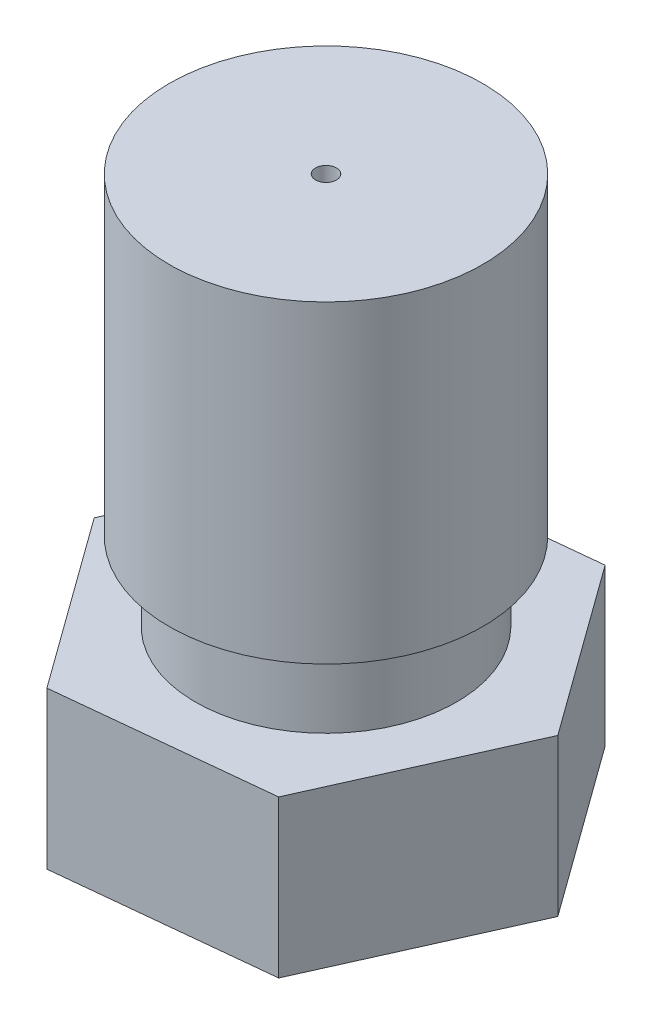
ISO-10303-21;
HEADER;
FILE_DESCRIPTION(('STEP AP214'),'2;1');
FILE_NAME('part.step','',(''),(''),'','','');
FILE_SCHEMA(('AUTOMOTIVE_DESIGN { 1 0 10303 214 1 1 1 1 }'));
ENDSEC;
DATA;
#1=APPLICATION_CONTEXT('core data for automotive mechanical design processes');
#2=APPLICATION_PROTOCOL_DEFINITION('international standard','automotive_design',2000,#1);
#3=PRODUCT_CONTEXT('',#1,'mechanical');
#4=PRODUCT('Part','Part','',(#3));
#5=PRODUCT_RELATED_PRODUCT_CATEGORY('part','',(#4));
#6=PRODUCT_DEFINITION_FORMATION('','',#4);
#7=PRODUCT_DEFINITION_CONTEXT('part definition',#1,'design');
#8=PRODUCT_DEFINITION('design','',#6,#7);
#9=PRODUCT_DEFINITION_SHAPE('','',#8);
#10=(LENGTH_UNIT() NAMED_UNIT(*) SI_UNIT(.MILLI.,.METRE.));
#11=(NAMED_UNIT(*) PLANE_ANGLE_UNIT() SI_UNIT($,.RADIAN.));
#12=(NAMED_UNIT(*) SI_UNIT($,.STERADIAN.) SOLID_ANGLE_UNIT());
#13=UNCERTAINTY_MEASURE_WITH_UNIT(LENGTH_MEASURE(1.E-05),#10,'distance_accuracy_value','');
#14=(GEOMETRIC_REPRESENTATION_CONTEXT(3) GLOBAL_UNCERTAINTY_ASSIGNED_CONTEXT((#13)) GLOBAL_UNIT_ASSIGNED_CONTEXT((#10,
#11,#12)) REPRESENTATION_CONTEXT('',''));
#15=CARTESIAN_POINT('',(0.,0.,0.));
#16=DIRECTION('',(0.,0.,1.));
#17=DIRECTION('',(1.,0.,0.));
#18=AXIS2_PLACEMENT_3D('',#15,#16,#17);
#19=CARTESIAN_POINT('',(0.,12.5,0.));
#20=DIRECTION('',(0.,-1.,0.));
#21=DIRECTION('',(1.,0.,0.));
#22=AXIS2_PLACEMENT_3D('',#19,#20,#21);
#23=PLANE('',#22);
#24=CARTESIAN_POINT('',(0.,12.5,0.));
#25=DIRECTION('',(0.,-1.,0.));
#26=DIRECTION('',(1.,0.,0.));
#27=AXIS2_PLACEMENT_3D('',#24,#25,#26);
#28=CIRCLE('',#27,0.2);
#29=CARTESIAN_POINT('',(0.200000000000001,12.5,0.));
#30=VERTEX_POINT('',#29);
#31=EDGE_CURVE('E151',#30,#30,#28,.T.);
#32=ORIENTED_EDGE('',*,*,#31,.T.);
#33=EDGE_LOOP('',(#32));
#34=FACE_BOUND('',#33,.T.);
#35=CARTESIAN_POINT('',(0.,12.5,0.));
#36=DIRECTION('',(0.,1.,0.));
#37=DIRECTION('',(-1.,0.,0.));
#38=AXIS2_PLACEMENT_3D('',#35,#36,#37);
#39=CIRCLE('',#38,3.);
#40=CARTESIAN_POINT('',(-3.,12.5,0.));
#41=VERTEX_POINT('',#40);
#42=EDGE_CURVE('E107',#41,#41,#39,.T.);
#43=ORIENTED_EDGE('',*,*,#42,.T.);
#44=EDGE_LOOP('',(#43));
#45=FACE_BOUND('',#44,.T.);
#46=ADVANCED_FACE('F33',(#34,#45),#23,.F.);
#47=CARTESIAN_POINT('',(0.,5.,0.));
#48=DIRECTION('',(0.,-1.,0.));
#49=DIRECTION('',(1.,0.,0.));
#50=AXIS2_PLACEMENT_3D('',#47,#48,#49);
#51=PLANE('',#50);
#52=CARTESIAN_POINT('',(0.,5.,0.));
#53=DIRECTION('',(0.,1.,0.));
#54=DIRECTION('',(-1.,0.,0.));
#55=AXIS2_PLACEMENT_3D('',#52,#53,#54);
#56=CIRCLE('',#55,2.5);
#57=CARTESIAN_POINT('',(-2.5,5.,0.));
#58=VERTEX_POINT('',#57);
#59=EDGE_CURVE('E116',#58,#58,#56,.T.);
#60=ORIENTED_EDGE('',*,*,#59,.F.);
#61=EDGE_LOOP('',(#60));
#62=FACE_BOUND('',#61,.T.);
#63=DIRECTION('',(-0.40858111873719,0.,0.912722011026066));
#64=VECTOR('',#63,1.);
#65=CARTESIAN_POINT('',(-4.02015750470173,5.,0.414327130084022));
#66=LINE('',#65,#64);
#67=CARTESIAN_POINT('',(-2.36889657248073,5.,-3.27439496124435));
#68=VERTEX_POINT('',#67);
#69=CARTESIAN_POINT('',(-4.02015750470173,5.,0.414327130084022));
#70=VERTEX_POINT('',#69);
#71=EDGE_CURVE('E105',#68,#70,#66,.T.);
#72=ORIENTED_EDGE('',*,*,#71,.T.);
#73=DIRECTION('',(0.586149888773199,0.,0.810202633846106));
#74=VECTOR('',#73,1.);
#75=CARTESIAN_POINT('',(-1.651260932221,5.,3.68872209132837));
#76=LINE('',#75,#74);
#77=CARTESIAN_POINT('',(-1.651260932221,5.,3.68872209132837));
#78=VERTEX_POINT('',#77);
#79=EDGE_CURVE('E49',#70,#78,#76,.T.);
#80=ORIENTED_EDGE('',*,*,#79,.T.);
#81=DIRECTION('',(0.994731007510389,0.,-0.102519377179961));
#82=VECTOR('',#81,1.);
#83=CARTESIAN_POINT('',(2.36889657248073,5.,3.27439496124435));
#84=LINE('',#83,#82);
#85=CARTESIAN_POINT('',(2.36889657248073,5.,3.27439496124435));
#86=VERTEX_POINT('',#85);
#87=EDGE_CURVE('E82',#78,#86,#84,.T.);
#88=ORIENTED_EDGE('',*,*,#87,.T.);
#89=DIRECTION('',(0.408581118737189,0.,-0.912722011026066));
#90=VECTOR('',#89,1.);
#91=CARTESIAN_POINT('',(4.02015750470173,5.,-0.414327130084022));
#92=LINE('',#91,#90);
#93=CARTESIAN_POINT('',(4.02015750470173,5.,-0.414327130084022));
#94=VERTEX_POINT('',#93);
#95=EDGE_CURVE('E76',#86,#94,#92,.T.);
#96=ORIENTED_EDGE('',*,*,#95,.T.);
#97=DIRECTION('',(-0.586149888773199,0.,-0.810202633846106));
#98=VECTOR('',#97,1.);
#99=CARTESIAN_POINT('',(1.65126093222101,5.,-3.68872209132837));
#100=LINE('',#99,#98);
#101=CARTESIAN_POINT('',(1.65126093222101,5.,-3.68872209132837));
#102=VERTEX_POINT('',#101);
#103=EDGE_CURVE('E65',#94,#102,#100,.T.);
#104=ORIENTED_EDGE('',*,*,#103,.T.);
#105=DIRECTION('',(-0.994731007510389,0.,0.102519377179961));
#106=VECTOR('',#105,1.);
#107=CARTESIAN_POINT('',(-2.36889657248073,5.,-3.27439496124435));
#108=LINE('',#107,#106);
#109=EDGE_CURVE('E77',#102,#68,#108,.T.);
#110=ORIENTED_EDGE('',*,*,#109,.T.);
#111=EDGE_LOOP('',(#72,#80,#88,#96,#104,#110));
#112=FACE_BOUND('',#111,.T.);
#113=ADVANCED_FACE('F80',(#62,#112),#51,.F.);
#114=CARTESIAN_POINT('',(0.,12.5,0.));
#115=DIRECTION('',(0.,1.,0.));
#116=DIRECTION('',(-1.,0.,0.));
#117=AXIS2_PLACEMENT_3D('',#114,#115,#116);
#118=CYLINDRICAL_SURFACE('',#117,2.5);
#119=CARTESIAN_POINT('',(0.,6.5,0.));
#120=DIRECTION('',(0.,1.,0.));
#121=DIRECTION('',(-1.,0.,0.));
#122=AXIS2_PLACEMENT_3D('',#119,#120,#121);
#123=CIRCLE('',#122,2.5);
#124=CARTESIAN_POINT('',(-2.5,6.5,0.));
#125=VERTEX_POINT('',#124);
#126=EDGE_CURVE('E113',#125,#125,#123,.T.);
#127=ORIENTED_EDGE('',*,*,#126,.F.);
#128=EDGE_LOOP('',(#127));
#129=FACE_BOUND('',#128,.T.);
#130=ORIENTED_EDGE('',*,*,#59,.T.);
#131=EDGE_LOOP('',(#130));
#132=FACE_BOUND('',#131,.T.);
#133=ADVANCED_FACE('F145',(#129,#132),#118,.T.);
#134=CARTESIAN_POINT('',(0.,6.5,0.));
#135=DIRECTION('',(0.,1.,0.));
#136=DIRECTION('',(-1.,0.,0.));
#137=AXIS2_PLACEMENT_3D('',#134,#135,#136);
#138=PLANE('',#137);
#139=CARTESIAN_POINT('',(0.,6.5,0.));
#140=DIRECTION('',(0.,1.,0.));
#141=DIRECTION('',(-1.,0.,0.));
#142=AXIS2_PLACEMENT_3D('',#139,#140,#141);
#143=CIRCLE('',#142,3.);
#144=CARTESIAN_POINT('',(-3.,6.5,0.));
#145=VERTEX_POINT('',#144);
#146=EDGE_CURVE('E110',#145,#145,#143,.T.);
#147=ORIENTED_EDGE('',*,*,#146,.F.);
#148=EDGE_LOOP('',(#147));
#149=FACE_BOUND('',#148,.T.);
#150=ORIENTED_EDGE('',*,*,#126,.T.);
#151=EDGE_LOOP('',(#150));
#152=FACE_BOUND('',#151,.T.);
#153=ADVANCED_FACE('F158',(#149,#152),#138,.F.);
#154=CARTESIAN_POINT('',(0.,12.5,0.));
#155=DIRECTION('',(0.,1.,0.));
#156=DIRECTION('',(-1.,0.,0.));
#157=AXIS2_PLACEMENT_3D('',#154,#155,#156);
#158=CYLINDRICAL_SURFACE('',#157,3.);
#159=ORIENTED_EDGE('',*,*,#42,.F.);
#160=EDGE_LOOP('',(#159));
#161=FACE_BOUND('',#160,.T.);
#162=ORIENTED_EDGE('',*,*,#146,.T.);
#163=EDGE_LOOP('',(#162));
#164=FACE_BOUND('',#163,.T.);
#165=ADVANCED_FACE('F154',(#161,#164),#158,.T.);
#166=CARTESIAN_POINT('',(-1.651260932221,15.9120735022568,3.68872209132837));
#167=DIRECTION('',(-0.810202633846105,0.,0.586149888773199));
#168=DIRECTION('',(0.586149888773199,0.,0.810202633846106));
#169=AXIS2_PLACEMENT_3D('',#166,#167,#168);
#170=PLANE('',#169);
#171=ORIENTED_EDGE('',*,*,#79,.F.);
#172=DIRECTION('',(0.,-1.,0.));
#173=VECTOR('',#172,1.);
#174=CARTESIAN_POINT('',(-4.02015750470173,15.9120735022568,0.414327130084022));
#175=LINE('',#174,#173);
#176=CARTESIAN_POINT('',(-4.02015750470173,2.,0.414327130084022));
#177=VERTEX_POINT('',#176);
#178=EDGE_CURVE('E102',#70,#177,#175,.T.);
#179=ORIENTED_EDGE('',*,*,#178,.T.);
#180=DIRECTION('',(-0.586149888773199,0.,-0.810202633846105));
#181=VECTOR('',#180,1.);
#182=CARTESIAN_POINT('',(-1.651260932221,2.,3.68872209132837));
#183=LINE('',#182,#181);
#184=CARTESIAN_POINT('',(-1.651260932221,2.,3.68872209132837));
#185=VERTEX_POINT('',#184);
#186=EDGE_CURVE('E210',#185,#177,#183,.T.);
#187=ORIENTED_EDGE('',*,*,#186,.F.);
#188=DIRECTION('',(0.,-1.,0.));
#189=VECTOR('',#188,1.);
#190=CARTESIAN_POINT('',(-1.651260932221,15.9120735022568,3.68872209132837));
#191=LINE('',#190,#189);
#192=EDGE_CURVE('E94',#78,#185,#191,.T.);
#193=ORIENTED_EDGE('',*,*,#192,.F.);
#194=EDGE_LOOP('',(#171,#179,#187,#193));
#195=FACE_BOUND('',#194,.T.);
#196=ADVANCED_FACE('F157',(#195),#170,.T.);
#197=CARTESIAN_POINT('',(2.36889657248073,15.9120735022568,3.27439496124435));
#198=DIRECTION('',(0.102519377179961,0.,0.994731007510389));
#199=DIRECTION('',(0.994731007510389,0.,-0.102519377179961));
#200=AXIS2_PLACEMENT_3D('',#197,#198,#199);
#201=PLANE('',#200);
#202=ORIENTED_EDGE('',*,*,#87,.F.);
#203=ORIENTED_EDGE('',*,*,#192,.T.);
#204=DIRECTION('',(-0.994731007510389,0.,0.102519377179961));
#205=VECTOR('',#204,1.);
#206=CARTESIAN_POINT('',(2.36889657248073,2.,3.27439496124435));
#207=LINE('',#206,#205);
#208=CARTESIAN_POINT('',(2.36889657248073,2.,3.27439496124435));
#209=VERTEX_POINT('',#208);
#210=EDGE_CURVE('E104',#209,#185,#207,.T.);
#211=ORIENTED_EDGE('',*,*,#210,.F.);
#212=DIRECTION('',(0.,-1.,0.));
#213=VECTOR('',#212,1.);
#214=CARTESIAN_POINT('',(2.36889657248073,15.9120735022568,3.27439496124435));
#215=LINE('',#214,#213);
#216=EDGE_CURVE('E92',#86,#209,#215,.T.);
#217=ORIENTED_EDGE('',*,*,#216,.F.);
#218=EDGE_LOOP('',(#202,#203,#211,#217));
#219=FACE_BOUND('',#218,.T.);
#220=ADVANCED_FACE('F222',(#219),#201,.T.);
#221=CARTESIAN_POINT('',(4.02015750470173,15.9120735022568,-0.414327130084022));
#222=DIRECTION('',(0.912722011026066,0.,0.408581118737189));
#223=DIRECTION('',(0.408581118737189,0.,-0.912722011026066));
#224=AXIS2_PLACEMENT_3D('',#221,#222,#223);
#225=PLANE('',#224);
#226=DIRECTION('',(0.,-1.,0.));
#227=VECTOR('',#226,1.);
#228=CARTESIAN_POINT('',(4.02015750470173,15.9120735022568,-0.414327130084022));
#229=LINE('',#228,#227);
#230=CARTESIAN_POINT('',(4.02015750470173,2.,-0.414327130084022));
#231=VERTEX_POINT('',#230);
#232=EDGE_CURVE('E71',#94,#231,#229,.T.);
#233=ORIENTED_EDGE('',*,*,#232,.F.);
#234=ORIENTED_EDGE('',*,*,#95,.F.);
#235=ORIENTED_EDGE('',*,*,#216,.T.);
#236=DIRECTION('',(-0.408581118737189,0.,0.912722011026066));
#237=VECTOR('',#236,1.);
#238=CARTESIAN_POINT('',(4.02015750470173,2.,-0.414327130084022));
#239=LINE('',#238,#237);
#240=EDGE_CURVE('E90',#231,#209,#239,.T.);
#241=ORIENTED_EDGE('',*,*,#240,.F.);
#242=EDGE_LOOP('',(#233,#234,#235,#241));
#243=FACE_BOUND('',#242,.T.);
#244=ADVANCED_FACE('F88',(#243),#225,.T.);
#245=CARTESIAN_POINT('',(1.65126093222101,15.9120735022568,-3.68872209132837));
#246=DIRECTION('',(0.810202633846106,0.,-0.586149888773199));
#247=DIRECTION('',(-0.586149888773199,0.,-0.810202633846106));
#248=AXIS2_PLACEMENT_3D('',#245,#246,#247);
#249=PLANE('',#248);
#250=ORIENTED_EDGE('',*,*,#103,.F.);
#251=ORIENTED_EDGE('',*,*,#232,.T.);
#252=DIRECTION('',(0.586149888773199,0.,0.810202633846106));
#253=VECTOR('',#252,1.);
#254=CARTESIAN_POINT('',(1.65126093222101,2.,-3.68872209132837));
#255=LINE('',#254,#253);
#256=CARTESIAN_POINT('',(1.65126093222101,2.,-3.68872209132837));
#257=VERTEX_POINT('',#256);
#258=EDGE_CURVE('E183',#257,#231,#255,.T.);
#259=ORIENTED_EDGE('',*,*,#258,.F.);
#260=DIRECTION('',(0.,-1.,0.));
#261=VECTOR('',#260,1.);
#262=CARTESIAN_POINT('',(1.65126093222101,15.9120735022568,-3.68872209132837));
#263=LINE('',#262,#261);
#264=EDGE_CURVE('E73',#102,#257,#263,.T.);
#265=ORIENTED_EDGE('',*,*,#264,.F.);
#266=EDGE_LOOP('',(#250,#251,#259,#265));
#267=FACE_BOUND('',#266,.T.);
#268=ADVANCED_FACE('F67',(#267),#249,.T.);
#269=CARTESIAN_POINT('',(-2.36889657248073,15.9120735022568,-3.27439496124435));
#270=DIRECTION('',(-0.102519377179961,0.,-0.994731007510389));
#271=DIRECTION('',(-0.994731007510389,0.,0.102519377179961));
#272=AXIS2_PLACEMENT_3D('',#269,#270,#271);
#273=PLANE('',#272);
#274=ORIENTED_EDGE('',*,*,#109,.F.);
#275=ORIENTED_EDGE('',*,*,#264,.T.);
#276=DIRECTION('',(0.994731007510389,0.,-0.102519377179961));
#277=VECTOR('',#276,1.);
#278=CARTESIAN_POINT('',(-2.36889657248073,2.,-3.27439496124435));
#279=LINE('',#278,#277);
#280=CARTESIAN_POINT('',(-2.36889657248073,2.,-3.27439496124435));
#281=VERTEX_POINT('',#280);
#282=EDGE_CURVE('E189',#281,#257,#279,.T.);
#283=ORIENTED_EDGE('',*,*,#282,.F.);
#284=DIRECTION('',(0.,-1.,0.));
#285=VECTOR('',#284,1.);
#286=CARTESIAN_POINT('',(-2.36889657248073,15.9120735022568,-3.27439496124435));
#287=LINE('',#286,#285);
#288=EDGE_CURVE('E96',#68,#281,#287,.T.);
#289=ORIENTED_EDGE('',*,*,#288,.F.);
#290=EDGE_LOOP('',(#274,#275,#283,#289));
#291=FACE_BOUND('',#290,.T.);
#292=ADVANCED_FACE('F136',(#291),#273,.T.);
#293=CARTESIAN_POINT('',(-4.02015750470173,15.9120735022568,0.414327130084022));
#294=DIRECTION('',(-0.912722011026066,0.,-0.40858111873719));
#295=DIRECTION('',(-0.40858111873719,0.,0.912722011026066));
#296=AXIS2_PLACEMENT_3D('',#293,#294,#295);
#297=PLANE('',#296);
#298=ORIENTED_EDGE('',*,*,#71,.F.);
#299=ORIENTED_EDGE('',*,*,#288,.T.);
#300=DIRECTION('',(0.40858111873719,0.,-0.912722011026066));
#301=VECTOR('',#300,1.);
#302=CARTESIAN_POINT('',(-4.02015750470173,2.,0.414327130084022));
#303=LINE('',#302,#301);
#304=EDGE_CURVE('E193',#177,#281,#303,.T.);
#305=ORIENTED_EDGE('',*,*,#304,.F.);
#306=ORIENTED_EDGE('',*,*,#178,.F.);
#307=EDGE_LOOP('',(#298,#299,#305,#306));
#308=FACE_BOUND('',#307,.T.);
#309=ADVANCED_FACE('F131',(#308),#297,.T.);
#310=CARTESIAN_POINT('',(0.,0.,0.));
#311=DIRECTION('',(0.,1.,0.));
#312=DIRECTION('',(-1.,0.,0.));
#313=AXIS2_PLACEMENT_3D('',#310,#311,#312);
#314=PLANE('',#313);
#315=CARTESIAN_POINT('',(0.,0.,0.));
#316=DIRECTION('',(0.,-1.,0.));
#317=DIRECTION('',(1.,0.,0.));
#318=AXIS2_PLACEMENT_3D('',#315,#316,#317);
#319=CIRCLE('',#318,0.2);
#320=CARTESIAN_POINT('',(0.2,0.,0.));
#321=VERTEX_POINT('',#320);
#322=EDGE_CURVE('E205',#321,#321,#319,.T.);
#323=ORIENTED_EDGE('',*,*,#322,.F.);
#324=EDGE_LOOP('',(#323));
#325=FACE_BOUND('',#324,.T.);
#326=CARTESIAN_POINT('',(0.,0.,0.));
#327=DIRECTION('',(0.,1.,0.));
#328=DIRECTION('',(-1.,0.,0.));
#329=AXIS2_PLACEMENT_3D('',#326,#327,#328);
#330=CIRCLE('',#329,0.5);
#331=CARTESIAN_POINT('',(-0.5,0.,0.));
#332=VERTEX_POINT('',#331);
#333=EDGE_CURVE('E11',#332,#332,#330,.T.);
#334=ORIENTED_EDGE('',*,*,#333,.F.);
#335=EDGE_LOOP('',(#334));
#336=FACE_BOUND('',#335,.T.);
#337=ADVANCED_FACE('F126',(#325,#336),#314,.F.);
#338=CARTESIAN_POINT('',(0.,0.,0.));
#339=DIRECTION('',(0.,1.,0.));
#340=DIRECTION('',(-1.,0.,0.));
#341=AXIS2_PLACEMENT_3D('',#338,#339,#340);
#342=CONICAL_SURFACE('',#341,0.5,0.610865238198027);
#343=CARTESIAN_POINT('',(0.,2.,0.));
#344=DIRECTION('',(0.,1.,0.));
#345=DIRECTION('',(-1.,0.,0.));
#346=AXIS2_PLACEMENT_3D('',#343,#344,#345);
#347=CIRCLE('',#346,1.90041507641946);
#348=CARTESIAN_POINT('',(-1.90041507641945,2.,0.));
#349=VERTEX_POINT('',#348);
#350=EDGE_CURVE('E41',#349,#349,#347,.T.);
#351=ORIENTED_EDGE('',*,*,#350,.F.);
#352=EDGE_LOOP('',(#351));
#353=FACE_BOUND('',#352,.T.);
#354=ORIENTED_EDGE('',*,*,#333,.T.);
#355=EDGE_LOOP('',(#354));
#356=FACE_BOUND('',#355,.T.);
#357=ADVANCED_FACE('F123',(#353,#356),#342,.T.);
#358=CARTESIAN_POINT('',(0.,2.,0.));
#359=DIRECTION('',(0.,1.,0.));
#360=DIRECTION('',(-1.,0.,0.));
#361=AXIS2_PLACEMENT_3D('',#358,#359,#360);
#362=PLANE('',#361);
#363=ORIENTED_EDGE('',*,*,#258,.T.);
#364=ORIENTED_EDGE('',*,*,#240,.T.);
#365=ORIENTED_EDGE('',*,*,#210,.T.);
#366=ORIENTED_EDGE('',*,*,#186,.T.);
#367=ORIENTED_EDGE('',*,*,#304,.T.);
#368=ORIENTED_EDGE('',*,*,#282,.T.);
#369=EDGE_LOOP('',(#363,#364,#365,#366,#367,#368));
#370=FACE_BOUND('',#369,.T.);
#371=ORIENTED_EDGE('',*,*,#350,.T.);
#372=EDGE_LOOP('',(#371));
#373=FACE_BOUND('',#372,.T.);
#374=ADVANCED_FACE('F121',(#370,#373),#362,.F.);
#375=CARTESIAN_POINT('',(0.,12.5,0.));
#376=DIRECTION('',(0.,-1.,0.));
#377=DIRECTION('',(1.,0.,0.));
#378=AXIS2_PLACEMENT_3D('',#375,#376,#377);
#379=CYLINDRICAL_SURFACE('',#378,0.2);
#380=ORIENTED_EDGE('',*,*,#31,.F.);
#381=EDGE_LOOP('',(#380));
#382=FACE_BOUND('',#381,.T.);
#383=ORIENTED_EDGE('',*,*,#322,.T.);
#384=EDGE_LOOP('',(#383));
#385=FACE_BOUND('',#384,.T.);
#386=ADVANCED_FACE('F175',(#382,#385),#379,.F.);
#387=CLOSED_SHELL('',(#46,#113,#133,#153,#165,#196,#220,#244,#268,#292,#309,#337,#357,#374,#386));
#388=MANIFOLD_SOLID_BREP('B2',#387);
#389=ADVANCED_BREP_SHAPE_REPRESENTATION('',(#18,#388),#14);
#390=SHAPE_DEFINITION_REPRESENTATION(#9,#389);
ENDSEC;
END-ISO-10303-21;
